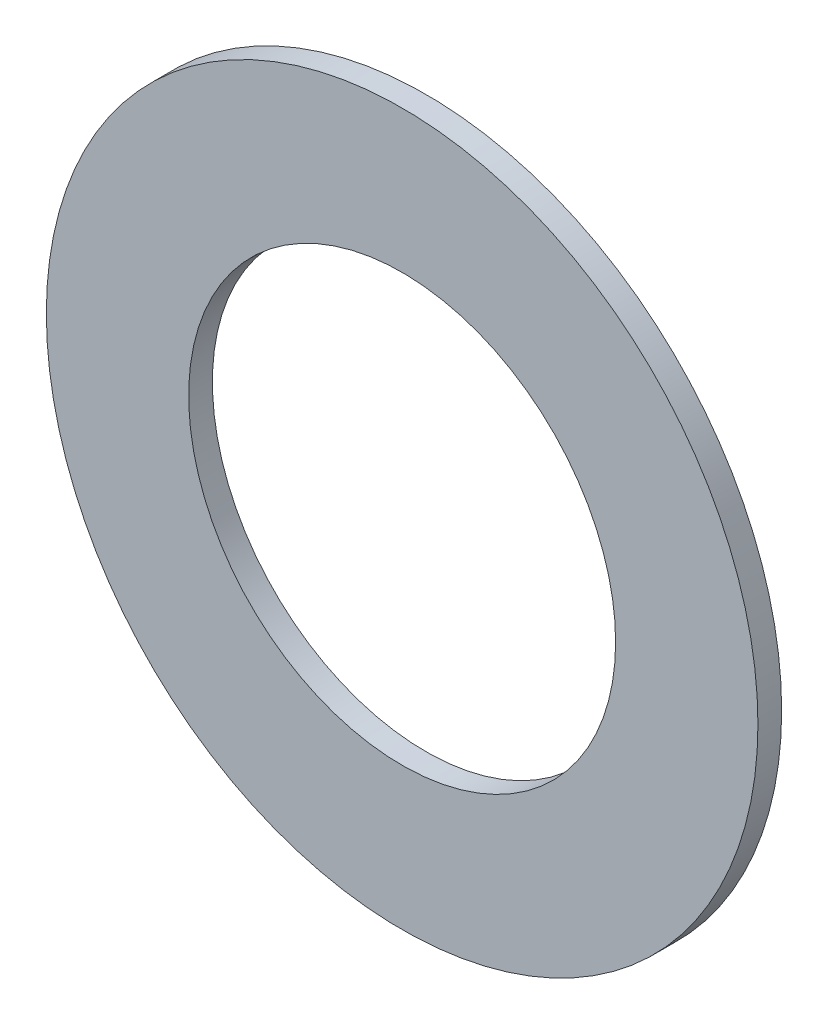
ISO-10303-21;
HEADER;
FILE_DESCRIPTION(('STEP AP214'),'2;1');
FILE_NAME('part.step','',(''),(''),'','','');
FILE_SCHEMA(('AUTOMOTIVE_DESIGN { 1 0 10303 214 1 1 1 1 }'));
ENDSEC;
DATA;
#1=APPLICATION_CONTEXT('core data for automotive mechanical design processes');
#2=APPLICATION_PROTOCOL_DEFINITION('international standard','automotive_design',2000,#1);
#3=PRODUCT_CONTEXT('',#1,'mechanical');
#4=PRODUCT('Part','Part','',(#3));
#5=PRODUCT_RELATED_PRODUCT_CATEGORY('part','',(#4));
#6=PRODUCT_DEFINITION_FORMATION('','',#4);
#7=PRODUCT_DEFINITION_CONTEXT('part definition',#1,'design');
#8=PRODUCT_DEFINITION('design','',#6,#7);
#9=PRODUCT_DEFINITION_SHAPE('','',#8);
#10=(LENGTH_UNIT() NAMED_UNIT(*) SI_UNIT(.MILLI.,.METRE.));
#11=(NAMED_UNIT(*) PLANE_ANGLE_UNIT() SI_UNIT($,.RADIAN.));
#12=(NAMED_UNIT(*) SI_UNIT($,.STERADIAN.) SOLID_ANGLE_UNIT());
#13=UNCERTAINTY_MEASURE_WITH_UNIT(LENGTH_MEASURE(1.E-05),#10,'distance_accuracy_value','');
#14=(GEOMETRIC_REPRESENTATION_CONTEXT(3) GLOBAL_UNCERTAINTY_ASSIGNED_CONTEXT((#13)) GLOBAL_UNIT_ASSIGNED_CONTEXT((#10,
#11,#12)) REPRESENTATION_CONTEXT('',''));
#15=CARTESIAN_POINT('',(0.,0.,0.));
#16=DIRECTION('',(0.,0.,1.));
#17=DIRECTION('',(1.,0.,0.));
#18=AXIS2_PLACEMENT_3D('',#15,#16,#17);
#19=CARTESIAN_POINT('',(0.,0.,0.25));
#20=DIRECTION('',(0.,0.,1.));
#21=DIRECTION('',(1.,0.,0.));
#22=AXIS2_PLACEMENT_3D('',#19,#20,#21);
#23=PLANE('',#22);
#24=CARTESIAN_POINT('',(0.,0.,0.25));
#25=DIRECTION('',(0.,0.,1.));
#26=DIRECTION('',(1.,0.,0.));
#27=AXIS2_PLACEMENT_3D('',#24,#25,#26);
#28=CIRCLE('',#27,3.75);
#29=CARTESIAN_POINT('',(3.75,0.,0.25));
#30=VERTEX_POINT('',#29);
#31=EDGE_CURVE('E10',#30,#30,#28,.T.);
#32=ORIENTED_EDGE('',*,*,#31,.T.);
#33=EDGE_LOOP('',(#32));
#34=FACE_BOUND('',#33,.T.);
#35=CARTESIAN_POINT('',(0.,0.,0.25));
#36=DIRECTION('',(0.,0.,1.));
#37=DIRECTION('',(1.,0.,0.));
#38=AXIS2_PLACEMENT_3D('',#35,#36,#37);
#39=CIRCLE('',#38,2.25);
#40=CARTESIAN_POINT('',(2.25,0.,0.25));
#41=VERTEX_POINT('',#40);
#42=EDGE_CURVE('E44',#41,#41,#39,.T.);
#43=ORIENTED_EDGE('',*,*,#42,.F.);
#44=EDGE_LOOP('',(#43));
#45=FACE_BOUND('',#44,.T.);
#46=ADVANCED_FACE('F33',(#34,#45),#23,.T.);
#47=CARTESIAN_POINT('',(0.,0.,0.));
#48=DIRECTION('',(0.,0.,1.));
#49=DIRECTION('',(1.,0.,0.));
#50=AXIS2_PLACEMENT_3D('',#47,#48,#49);
#51=PLANE('',#50);
#52=CARTESIAN_POINT('',(0.,0.,0.));
#53=DIRECTION('',(0.,0.,1.));
#54=DIRECTION('',(1.,0.,0.));
#55=AXIS2_PLACEMENT_3D('',#52,#53,#54);
#56=CIRCLE('',#55,3.75);
#57=CARTESIAN_POINT('',(3.75,0.,0.));
#58=VERTEX_POINT('',#57);
#59=EDGE_CURVE('E37',#58,#58,#56,.T.);
#60=ORIENTED_EDGE('',*,*,#59,.F.);
#61=EDGE_LOOP('',(#60));
#62=FACE_BOUND('',#61,.T.);
#63=CARTESIAN_POINT('',(0.,0.,0.));
#64=DIRECTION('',(0.,0.,1.));
#65=DIRECTION('',(1.,0.,0.));
#66=AXIS2_PLACEMENT_3D('',#63,#64,#65);
#67=CIRCLE('',#66,2.25);
#68=CARTESIAN_POINT('',(2.25,0.,0.));
#69=VERTEX_POINT('',#68);
#70=EDGE_CURVE('E46',#69,#69,#67,.T.);
#71=ORIENTED_EDGE('',*,*,#70,.T.);
#72=EDGE_LOOP('',(#71));
#73=FACE_BOUND('',#72,.T.);
#74=ADVANCED_FACE('F56',(#62,#73),#51,.F.);
#75=CARTESIAN_POINT('',(0.,0.,0.25));
#76=DIRECTION('',(0.,0.,-1.));
#77=DIRECTION('',(-1.,0.,0.));
#78=AXIS2_PLACEMENT_3D('',#75,#76,#77);
#79=CYLINDRICAL_SURFACE('',#78,3.75);
#80=ORIENTED_EDGE('',*,*,#31,.F.);
#81=EDGE_LOOP('',(#80));
#82=FACE_BOUND('',#81,.T.);
#83=ORIENTED_EDGE('',*,*,#59,.T.);
#84=EDGE_LOOP('',(#83));
#85=FACE_BOUND('',#84,.T.);
#86=ADVANCED_FACE('F35',(#82,#85),#79,.T.);
#87=CARTESIAN_POINT('',(0.,0.,0.25));
#88=DIRECTION('',(0.,0.,-1.));
#89=DIRECTION('',(-1.,0.,0.));
#90=AXIS2_PLACEMENT_3D('',#87,#88,#89);
#91=CYLINDRICAL_SURFACE('',#90,2.25);
#92=ORIENTED_EDGE('',*,*,#42,.T.);
#93=EDGE_LOOP('',(#92));
#94=FACE_BOUND('',#93,.T.);
#95=ORIENTED_EDGE('',*,*,#70,.F.);
#96=EDGE_LOOP('',(#95));
#97=FACE_BOUND('',#96,.T.);
#98=ADVANCED_FACE('F52',(#94,#97),#91,.F.);
#99=CLOSED_SHELL('',(#46,#74,#86,#98));
#100=MANIFOLD_SOLID_BREP('B2',#99);
#101=ADVANCED_BREP_SHAPE_REPRESENTATION('',(#18,#100),#14);
#102=SHAPE_DEFINITION_REPRESENTATION(#9,#101);
ENDSEC;
END-ISO-10303-21;
